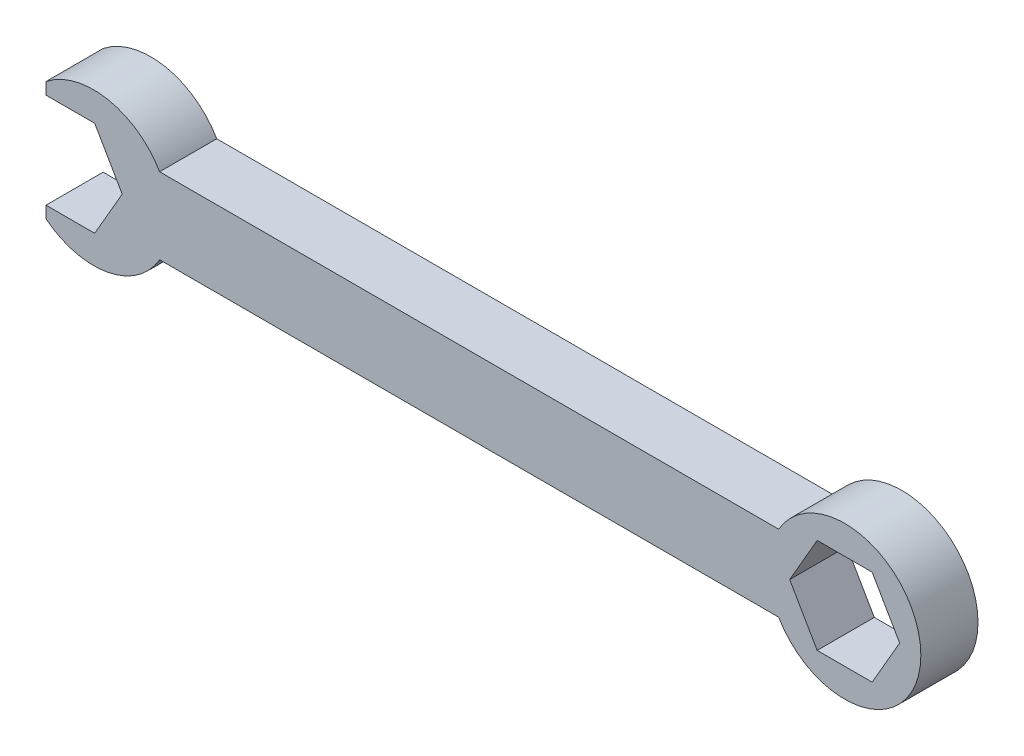
ISO-10303-21;
HEADER;
FILE_DESCRIPTION(('STEP AP214'),'2;1');
FILE_NAME('part.step','',(''),(''),'','','');
FILE_SCHEMA(('AUTOMOTIVE_DESIGN { 1 0 10303 214 1 1 1 1 }'));
ENDSEC;
DATA;
#1=APPLICATION_CONTEXT('core data for automotive mechanical design processes');
#2=APPLICATION_PROTOCOL_DEFINITION('international standard','automotive_design',2000,#1);
#3=PRODUCT_CONTEXT('',#1,'mechanical');
#4=PRODUCT('Part','Part','',(#3));
#5=PRODUCT_RELATED_PRODUCT_CATEGORY('part','',(#4));
#6=PRODUCT_DEFINITION_FORMATION('','',#4);
#7=PRODUCT_DEFINITION_CONTEXT('part definition',#1,'design');
#8=PRODUCT_DEFINITION('design','',#6,#7);
#9=PRODUCT_DEFINITION_SHAPE('','',#8);
#10=(LENGTH_UNIT() NAMED_UNIT(*) SI_UNIT(.MILLI.,.METRE.));
#11=(NAMED_UNIT(*) PLANE_ANGLE_UNIT() SI_UNIT($,.RADIAN.));
#12=(NAMED_UNIT(*) SI_UNIT($,.STERADIAN.) SOLID_ANGLE_UNIT());
#13=UNCERTAINTY_MEASURE_WITH_UNIT(LENGTH_MEASURE(1.E-05),#10,'distance_accuracy_value','');
#14=(GEOMETRIC_REPRESENTATION_CONTEXT(3) GLOBAL_UNCERTAINTY_ASSIGNED_CONTEXT((#13)) GLOBAL_UNIT_ASSIGNED_CONTEXT((#10,
#11,#12)) REPRESENTATION_CONTEXT('',''));
#15=CARTESIAN_POINT('',(0.,0.,0.));
#16=DIRECTION('',(0.,0.,1.));
#17=DIRECTION('',(1.,0.,0.));
#18=AXIS2_PLACEMENT_3D('',#15,#16,#17);
#19=CARTESIAN_POINT('',(0.,5.08000000000001,7.62));
#20=DIRECTION('',(0.,-1.,0.));
#21=DIRECTION('',(1.,0.,0.));
#22=AXIS2_PLACEMENT_3D('',#19,#20,#21);
#23=PLANE('',#22);
#24=DIRECTION('',(-1.,0.,0.));
#25=VECTOR('',#24,1.);
#26=CARTESIAN_POINT('',(0.,5.08000000000001,0.));
#27=LINE('',#26,#25);
#28=CARTESIAN_POINT('',(-8.79881810244989,5.08000000000001,0.));
#29=VERTEX_POINT('',#28);
#30=CARTESIAN_POINT('',(-91.3488181024499,5.08,0.));
#31=VERTEX_POINT('',#30);
#32=EDGE_CURVE('E214',#29,#31,#27,.T.);
#33=ORIENTED_EDGE('',*,*,#32,.T.);
#34=DIRECTION('',(0.,0.,-1.));
#35=VECTOR('',#34,1.);
#36=CARTESIAN_POINT('',(-91.3488181024499,5.08,7.62));
#37=LINE('',#36,#35);
#38=CARTESIAN_POINT('',(-91.3488181024499,5.08,7.62));
#39=VERTEX_POINT('',#38);
#40=EDGE_CURVE('E11',#39,#31,#37,.T.);
#41=ORIENTED_EDGE('',*,*,#40,.F.);
#42=DIRECTION('',(-1.,0.,0.));
#43=VECTOR('',#42,1.);
#44=CARTESIAN_POINT('',(0.,5.08000000000001,7.62));
#45=LINE('',#44,#43);
#46=CARTESIAN_POINT('',(-8.79881810244989,5.08000000000001,7.62));
#47=VERTEX_POINT('',#46);
#48=EDGE_CURVE('E295',#47,#39,#45,.T.);
#49=ORIENTED_EDGE('',*,*,#48,.F.);
#50=DIRECTION('',(0.,0.,-1.));
#51=VECTOR('',#50,1.);
#52=CARTESIAN_POINT('',(-8.79881810244989,5.08000000000001,7.62));
#53=LINE('',#52,#51);
#54=EDGE_CURVE('E238',#47,#29,#53,.T.);
#55=ORIENTED_EDGE('',*,*,#54,.T.);
#56=EDGE_LOOP('',(#33,#41,#49,#55));
#57=FACE_BOUND('',#56,.T.);
#58=ADVANCED_FACE('F38',(#57),#23,.F.);
#59=CARTESIAN_POINT('',(-100.1476362049,0.,7.62));
#60=DIRECTION('',(0.,0.,-1.));
#61=DIRECTION('',(-1.,0.,0.));
#62=AXIS2_PLACEMENT_3D('',#59,#60,#61);
#63=CYLINDRICAL_SURFACE('',#62,10.16);
#64=CARTESIAN_POINT('',(-100.1476362049,0.,0.));
#65=DIRECTION('',(0.,0.,1.));
#66=DIRECTION('',(1.,0.,0.));
#67=AXIS2_PLACEMENT_3D('',#64,#65,#66);
#68=CIRCLE('',#67,10.16);
#69=CARTESIAN_POINT('',(-106.4976362049,7.93114745796597,0.));
#70=VERTEX_POINT('',#69);
#71=EDGE_CURVE('E217',#31,#70,#68,.T.);
#72=ORIENTED_EDGE('',*,*,#71,.T.);
#73=DIRECTION('',(0.,0.,-1.));
#74=VECTOR('',#73,1.);
#75=CARTESIAN_POINT('',(-106.4976362049,7.93114745796597,7.62));
#76=LINE('',#75,#74);
#77=CARTESIAN_POINT('',(-106.4976362049,7.93114745796597,7.62));
#78=VERTEX_POINT('',#77);
#79=EDGE_CURVE('E48',#78,#70,#76,.T.);
#80=ORIENTED_EDGE('',*,*,#79,.F.);
#81=CARTESIAN_POINT('',(-100.1476362049,0.,7.62));
#82=DIRECTION('',(0.,0.,1.));
#83=DIRECTION('',(1.,0.,0.));
#84=AXIS2_PLACEMENT_3D('',#81,#82,#83);
#85=CIRCLE('',#84,10.16);
#86=EDGE_CURVE('E180',#39,#78,#85,.T.);
#87=ORIENTED_EDGE('',*,*,#86,.F.);
#88=ORIENTED_EDGE('',*,*,#40,.T.);
#89=EDGE_LOOP('',(#72,#80,#87,#88));
#90=FACE_BOUND('',#89,.T.);
#91=ADVANCED_FACE('F332',(#90),#63,.T.);
#92=CARTESIAN_POINT('',(-106.4976362049,0.,7.62));
#93=DIRECTION('',(1.,0.,0.));
#94=DIRECTION('',(0.,0.,-1.));
#95=AXIS2_PLACEMENT_3D('',#92,#93,#94);
#96=PLANE('',#95);
#97=DIRECTION('',(0.,-1.,0.));
#98=VECTOR('',#97,1.);
#99=CARTESIAN_POINT('',(-106.4976362049,0.,0.));
#100=LINE('',#99,#98);
#101=CARTESIAN_POINT('',(-106.4976362049,6.35,0.));
#102=VERTEX_POINT('',#101);
#103=EDGE_CURVE('E219',#70,#102,#100,.T.);
#104=ORIENTED_EDGE('',*,*,#103,.T.);
#105=DIRECTION('',(0.,0.,-1.));
#106=VECTOR('',#105,1.);
#107=CARTESIAN_POINT('',(-106.4976362049,6.35,7.62));
#108=LINE('',#107,#106);
#109=CARTESIAN_POINT('',(-106.4976362049,6.35,7.62));
#110=VERTEX_POINT('',#109);
#111=EDGE_CURVE('E250',#110,#102,#108,.T.);
#112=ORIENTED_EDGE('',*,*,#111,.F.);
#113=DIRECTION('',(0.,-1.,0.));
#114=VECTOR('',#113,1.);
#115=CARTESIAN_POINT('',(-106.4976362049,0.,7.62));
#116=LINE('',#115,#114);
#117=EDGE_CURVE('E297',#78,#110,#116,.T.);
#118=ORIENTED_EDGE('',*,*,#117,.F.);
#119=ORIENTED_EDGE('',*,*,#79,.T.);
#120=EDGE_LOOP('',(#104,#112,#118,#119));
#121=FACE_BOUND('',#120,.T.);
#122=ADVANCED_FACE('F326',(#121),#96,.F.);
#123=CARTESIAN_POINT('',(0.,6.35000000000005,7.62));
#124=DIRECTION('',(0.,-1.,0.));
#125=DIRECTION('',(1.,0.,0.));
#126=AXIS2_PLACEMENT_3D('',#123,#124,#125);
#127=PLANE('',#126);
#128=DIRECTION('',(-1.,0.,0.));
#129=VECTOR('',#128,1.);
#130=CARTESIAN_POINT('',(0.,6.35000000000005,0.));
#131=LINE('',#130,#129);
#132=CARTESIAN_POINT('',(-100.003810414254,6.34999999999999,0.));
#133=VERTEX_POINT('',#132);
#134=EDGE_CURVE('E222',#133,#102,#131,.T.);
#135=ORIENTED_EDGE('',*,*,#134,.F.);
#136=DIRECTION('',(0.,0.,-1.));
#137=VECTOR('',#136,1.);
#138=CARTESIAN_POINT('',(-100.003810414254,6.34999999999999,7.62));
#139=LINE('',#138,#137);
#140=CARTESIAN_POINT('',(-100.003810414254,6.34999999999999,7.62));
#141=VERTEX_POINT('',#140);
#142=EDGE_CURVE('E248',#141,#133,#139,.T.);
#143=ORIENTED_EDGE('',*,*,#142,.F.);
#144=DIRECTION('',(-1.,0.,0.));
#145=VECTOR('',#144,1.);
#146=CARTESIAN_POINT('',(0.,6.35000000000005,7.62));
#147=LINE('',#146,#145);
#148=EDGE_CURVE('E299',#141,#110,#147,.T.);
#149=ORIENTED_EDGE('',*,*,#148,.T.);
#150=ORIENTED_EDGE('',*,*,#111,.T.);
#151=EDGE_LOOP('',(#135,#143,#149,#150));
#152=FACE_BOUND('',#151,.T.);
#153=ADVANCED_FACE('F335',(#152),#127,.T.);
#154=CARTESIAN_POINT('',(-72.2532271536748,-41.7154201469933,7.62));
#155=DIRECTION('',(-0.866025403784439,-0.5,0.));
#156=DIRECTION('',(0.5,-0.866025403784439,0.));
#157=AXIS2_PLACEMENT_3D('',#154,#155,#156);
#158=PLANE('',#157);
#159=DIRECTION('',(-0.5,0.866025403784439,0.));
#160=VECTOR('',#159,1.);
#161=CARTESIAN_POINT('',(-72.2532271536748,-41.7154201469933,0.));
#162=LINE('',#161,#160);
#163=CARTESIAN_POINT('',(-96.3376362048998,0.,0.));
#164=VERTEX_POINT('',#163);
#165=EDGE_CURVE('E226',#164,#133,#162,.T.);
#166=ORIENTED_EDGE('',*,*,#165,.F.);
#167=DIRECTION('',(0.,0.,-1.));
#168=VECTOR('',#167,1.);
#169=CARTESIAN_POINT('',(-96.3376362048998,0.,7.62));
#170=LINE('',#169,#168);
#171=CARTESIAN_POINT('',(-96.3376362048998,0.,7.62));
#172=VERTEX_POINT('',#171);
#173=EDGE_CURVE('E246',#172,#164,#170,.T.);
#174=ORIENTED_EDGE('',*,*,#173,.F.);
#175=DIRECTION('',(-0.5,0.866025403784439,0.));
#176=VECTOR('',#175,1.);
#177=CARTESIAN_POINT('',(-72.2532271536748,-41.7154201469933,7.62));
#178=LINE('',#177,#176);
#179=EDGE_CURVE('E302',#172,#141,#178,.T.);
#180=ORIENTED_EDGE('',*,*,#179,.T.);
#181=ORIENTED_EDGE('',*,*,#142,.T.);
#182=EDGE_LOOP('',(#166,#174,#180,#181));
#183=FACE_BOUND('',#182,.T.);
#184=ADVANCED_FACE('F317',(#183),#158,.T.);
#185=CARTESIAN_POINT('',(-72.253227153675,41.7154201469932,7.62));
#186=DIRECTION('',(-0.86602540378444,0.499999999999998,0.));
#187=DIRECTION('',(-0.499999999999998,-0.86602540378444,0.));
#188=AXIS2_PLACEMENT_3D('',#185,#186,#187);
#189=PLANE('',#188);
#190=DIRECTION('',(0.499999999999998,0.86602540378444,0.));
#191=VECTOR('',#190,1.);
#192=CARTESIAN_POINT('',(-72.253227153675,41.7154201469932,0.));
#193=LINE('',#192,#191);
#194=CARTESIAN_POINT('',(-100.003810414254,-6.35,0.));
#195=VERTEX_POINT('',#194);
#196=EDGE_CURVE('E229',#195,#164,#193,.T.);
#197=ORIENTED_EDGE('',*,*,#196,.F.);
#198=DIRECTION('',(0.,0.,-1.));
#199=VECTOR('',#198,1.);
#200=CARTESIAN_POINT('',(-100.003810414254,-6.35,7.62));
#201=LINE('',#200,#199);
#202=CARTESIAN_POINT('',(-100.003810414254,-6.35,7.62));
#203=VERTEX_POINT('',#202);
#204=EDGE_CURVE('E244',#203,#195,#201,.T.);
#205=ORIENTED_EDGE('',*,*,#204,.F.);
#206=DIRECTION('',(0.499999999999998,0.86602540378444,0.));
#207=VECTOR('',#206,1.);
#208=CARTESIAN_POINT('',(-72.253227153675,41.7154201469932,7.62));
#209=LINE('',#208,#207);
#210=EDGE_CURVE('E304',#203,#172,#209,.T.);
#211=ORIENTED_EDGE('',*,*,#210,.T.);
#212=ORIENTED_EDGE('',*,*,#173,.T.);
#213=EDGE_LOOP('',(#197,#205,#211,#212));
#214=FACE_BOUND('',#213,.T.);
#215=ADVANCED_FACE('F319',(#214),#189,.T.);
#216=CARTESIAN_POINT('',(0.,-6.34999999999994,7.62));
#217=DIRECTION('',(0.,1.,0.));
#218=DIRECTION('',(-1.,0.,0.));
#219=AXIS2_PLACEMENT_3D('',#216,#217,#218);
#220=PLANE('',#219);
#221=DIRECTION('',(1.,0.,0.));
#222=VECTOR('',#221,1.);
#223=CARTESIAN_POINT('',(0.,-6.34999999999994,0.));
#224=LINE('',#223,#222);
#225=CARTESIAN_POINT('',(-106.4976362049,-6.35,0.));
#226=VERTEX_POINT('',#225);
#227=EDGE_CURVE('E232',#226,#195,#224,.T.);
#228=ORIENTED_EDGE('',*,*,#227,.F.);
#229=DIRECTION('',(0.,0.,-1.));
#230=VECTOR('',#229,1.);
#231=CARTESIAN_POINT('',(-106.4976362049,-6.35,7.62));
#232=LINE('',#231,#230);
#233=CARTESIAN_POINT('',(-106.4976362049,-6.35,7.62));
#234=VERTEX_POINT('',#233);
#235=EDGE_CURVE('E242',#234,#226,#232,.T.);
#236=ORIENTED_EDGE('',*,*,#235,.F.);
#237=DIRECTION('',(1.,0.,0.));
#238=VECTOR('',#237,1.);
#239=CARTESIAN_POINT('',(0.,-6.34999999999994,7.62));
#240=LINE('',#239,#238);
#241=EDGE_CURVE('E193',#234,#203,#240,.T.);
#242=ORIENTED_EDGE('',*,*,#241,.T.);
#243=ORIENTED_EDGE('',*,*,#204,.T.);
#244=EDGE_LOOP('',(#228,#236,#242,#243));
#245=FACE_BOUND('',#244,.T.);
#246=ADVANCED_FACE('F311',(#245),#220,.T.);
#247=CARTESIAN_POINT('',(-106.4976362049,-7.93114745796597,0.));
#248=VERTEX_POINT('',#247);
#249=EDGE_CURVE('E223',#226,#248,#100,.T.);
#250=ORIENTED_EDGE('',*,*,#249,.T.);
#251=DIRECTION('',(0.,0.,-1.));
#252=VECTOR('',#251,1.);
#253=CARTESIAN_POINT('',(-106.4976362049,-7.93114745796597,7.62));
#254=LINE('',#253,#252);
#255=CARTESIAN_POINT('',(-106.4976362049,-7.93114745796597,7.62));
#256=VERTEX_POINT('',#255);
#257=EDGE_CURVE('E185',#256,#248,#254,.T.);
#258=ORIENTED_EDGE('',*,*,#257,.F.);
#259=EDGE_CURVE('E175',#234,#256,#116,.T.);
#260=ORIENTED_EDGE('',*,*,#259,.F.);
#261=ORIENTED_EDGE('',*,*,#235,.T.);
#262=EDGE_LOOP('',(#250,#258,#260,#261));
#263=FACE_BOUND('',#262,.T.);
#264=ADVANCED_FACE('F323',(#263),#96,.F.);
#265=CARTESIAN_POINT('',(-91.3488181024499,-5.08,0.));
#266=VERTEX_POINT('',#265);
#267=EDGE_CURVE('E184',#248,#266,#68,.T.);
#268=ORIENTED_EDGE('',*,*,#267,.T.);
#269=DIRECTION('',(0.,0.,-1.));
#270=VECTOR('',#269,1.);
#271=CARTESIAN_POINT('',(-91.3488181024499,-5.08,7.62));
#272=LINE('',#271,#270);
#273=CARTESIAN_POINT('',(-91.3488181024499,-5.08,7.62));
#274=VERTEX_POINT('',#273);
#275=EDGE_CURVE('E181',#274,#266,#272,.T.);
#276=ORIENTED_EDGE('',*,*,#275,.F.);
#277=EDGE_CURVE('E168',#256,#274,#85,.T.);
#278=ORIENTED_EDGE('',*,*,#277,.F.);
#279=ORIENTED_EDGE('',*,*,#257,.T.);
#280=EDGE_LOOP('',(#268,#276,#278,#279));
#281=FACE_BOUND('',#280,.T.);
#282=ADVANCED_FACE('F182',(#281),#63,.T.);
#283=CARTESIAN_POINT('',(0.,-5.08,7.62));
#284=DIRECTION('',(0.,1.,0.));
#285=DIRECTION('',(-1.,0.,0.));
#286=AXIS2_PLACEMENT_3D('',#283,#284,#285);
#287=PLANE('',#286);
#288=DIRECTION('',(1.,0.,0.));
#289=VECTOR('',#288,1.);
#290=CARTESIAN_POINT('',(0.,-5.08,0.));
#291=LINE('',#290,#289);
#292=CARTESIAN_POINT('',(-8.7988181024499,-5.08,0.));
#293=VERTEX_POINT('',#292);
#294=EDGE_CURVE('E113',#266,#293,#291,.T.);
#295=ORIENTED_EDGE('',*,*,#294,.T.);
#296=DIRECTION('',(0.,0.,-1.));
#297=VECTOR('',#296,1.);
#298=CARTESIAN_POINT('',(-8.7988181024499,-5.08,7.62));
#299=LINE('',#298,#297);
#300=CARTESIAN_POINT('',(-8.7988181024499,-5.08,7.62));
#301=VERTEX_POINT('',#300);
#302=EDGE_CURVE('E186',#301,#293,#299,.T.);
#303=ORIENTED_EDGE('',*,*,#302,.F.);
#304=DIRECTION('',(1.,0.,0.));
#305=VECTOR('',#304,1.);
#306=CARTESIAN_POINT('',(0.,-5.08,7.62));
#307=LINE('',#306,#305);
#308=EDGE_CURVE('E172',#274,#301,#307,.T.);
#309=ORIENTED_EDGE('',*,*,#308,.F.);
#310=ORIENTED_EDGE('',*,*,#275,.T.);
#311=EDGE_LOOP('',(#295,#303,#309,#310));
#312=FACE_BOUND('',#311,.T.);
#313=ADVANCED_FACE('F188',(#312),#287,.F.);
#314=CARTESIAN_POINT('',(5.49926131403119,-3.175,7.62));
#315=DIRECTION('',(-0.866025403784439,0.5,0.));
#316=DIRECTION('',(-0.5,-0.866025403784439,0.));
#317=AXIS2_PLACEMENT_3D('',#314,#315,#316);
#318=PLANE('',#317);
#319=DIRECTION('',(0.5,0.866025403784439,0.));
#320=VECTOR('',#319,1.);
#321=CARTESIAN_POINT('',(5.49926131403119,-3.175,0.));
#322=LINE('',#321,#320);
#323=CARTESIAN_POINT('',(3.66617420935413,-6.35,0.));
#324=VERTEX_POINT('',#323);
#325=CARTESIAN_POINT('',(7.33234841870825,0.,0.));
#326=VERTEX_POINT('',#325);
#327=EDGE_CURVE('E196',#324,#326,#322,.T.);
#328=ORIENTED_EDGE('',*,*,#327,.F.);
#329=DIRECTION('',(0.,0.,-1.));
#330=VECTOR('',#329,1.);
#331=CARTESIAN_POINT('',(3.66617420935413,-6.35,7.62));
#332=LINE('',#331,#330);
#333=CARTESIAN_POINT('',(3.66617420935413,-6.35,7.62));
#334=VERTEX_POINT('',#333);
#335=EDGE_CURVE('E42',#334,#324,#332,.T.);
#336=ORIENTED_EDGE('',*,*,#335,.F.);
#337=DIRECTION('',(0.5,0.866025403784439,0.));
#338=VECTOR('',#337,1.);
#339=CARTESIAN_POINT('',(5.49926131403119,-3.175,7.62));
#340=LINE('',#339,#338);
#341=CARTESIAN_POINT('',(7.33234841870825,0.,7.62));
#342=VERTEX_POINT('',#341);
#343=EDGE_CURVE('E237',#334,#342,#340,.T.);
#344=ORIENTED_EDGE('',*,*,#343,.T.);
#345=DIRECTION('',(0.,0.,-1.));
#346=VECTOR('',#345,1.);
#347=CARTESIAN_POINT('',(7.33234841870825,0.,7.62));
#348=LINE('',#347,#346);
#349=EDGE_CURVE('E190',#342,#326,#348,.T.);
#350=ORIENTED_EDGE('',*,*,#349,.T.);
#351=EDGE_LOOP('',(#328,#336,#344,#350));
#352=FACE_BOUND('',#351,.T.);
#353=ADVANCED_FACE('F40',(#352),#318,.T.);
#354=CARTESIAN_POINT('',(0.,-6.35,7.62));
#355=DIRECTION('',(0.,1.,0.));
#356=DIRECTION('',(-1.,0.,0.));
#357=AXIS2_PLACEMENT_3D('',#354,#355,#356);
#358=PLANE('',#357);
#359=DIRECTION('',(1.,0.,0.));
#360=VECTOR('',#359,1.);
#361=CARTESIAN_POINT('',(0.,-6.35,0.));
#362=LINE('',#361,#360);
#363=CARTESIAN_POINT('',(-3.66617420935412,-6.35,0.));
#364=VERTEX_POINT('',#363);
#365=EDGE_CURVE('E199',#364,#324,#362,.T.);
#366=ORIENTED_EDGE('',*,*,#365,.F.);
#367=DIRECTION('',(0.,0.,-1.));
#368=VECTOR('',#367,1.);
#369=CARTESIAN_POINT('',(-3.66617420935412,-6.35,7.62));
#370=LINE('',#369,#368);
#371=CARTESIAN_POINT('',(-3.66617420935412,-6.35,7.62));
#372=VERTEX_POINT('',#371);
#373=EDGE_CURVE('E260',#372,#364,#370,.T.);
#374=ORIENTED_EDGE('',*,*,#373,.F.);
#375=DIRECTION('',(1.,0.,0.));
#376=VECTOR('',#375,1.);
#377=CARTESIAN_POINT('',(0.,-6.35,7.62));
#378=LINE('',#377,#376);
#379=EDGE_CURVE('E269',#372,#334,#378,.T.);
#380=ORIENTED_EDGE('',*,*,#379,.T.);
#381=ORIENTED_EDGE('',*,*,#335,.T.);
#382=EDGE_LOOP('',(#366,#374,#380,#381));
#383=FACE_BOUND('',#382,.T.);
#384=ADVANCED_FACE('F267',(#383),#358,.T.);
#385=CARTESIAN_POINT('',(-5.49926131403118,-3.175,7.62));
#386=DIRECTION('',(0.866025403784439,0.5,0.));
#387=DIRECTION('',(-0.5,0.866025403784439,0.));
#388=AXIS2_PLACEMENT_3D('',#385,#386,#387);
#389=PLANE('',#388);
#390=DIRECTION('',(0.5,-0.866025403784439,0.));
#391=VECTOR('',#390,1.);
#392=CARTESIAN_POINT('',(-5.49926131403118,-3.175,0.));
#393=LINE('',#392,#391);
#394=CARTESIAN_POINT('',(-7.33234841870825,0.,0.));
#395=VERTEX_POINT('',#394);
#396=EDGE_CURVE('E202',#395,#364,#393,.T.);
#397=ORIENTED_EDGE('',*,*,#396,.F.);
#398=DIRECTION('',(0.,0.,-1.));
#399=VECTOR('',#398,1.);
#400=CARTESIAN_POINT('',(-7.33234841870825,0.,7.62));
#401=LINE('',#400,#399);
#402=CARTESIAN_POINT('',(-7.33234841870825,0.,7.62));
#403=VERTEX_POINT('',#402);
#404=EDGE_CURVE('E259',#403,#395,#401,.T.);
#405=ORIENTED_EDGE('',*,*,#404,.F.);
#406=DIRECTION('',(0.5,-0.866025403784439,0.));
#407=VECTOR('',#406,1.);
#408=CARTESIAN_POINT('',(-5.49926131403118,-3.175,7.62));
#409=LINE('',#408,#407);
#410=EDGE_CURVE('E277',#403,#372,#409,.T.);
#411=ORIENTED_EDGE('',*,*,#410,.T.);
#412=ORIENTED_EDGE('',*,*,#373,.T.);
#413=EDGE_LOOP('',(#397,#405,#411,#412));
#414=FACE_BOUND('',#413,.T.);
#415=ADVANCED_FACE('F275',(#414),#389,.T.);
#416=CARTESIAN_POINT('',(-5.49926131403119,3.175,7.62));
#417=DIRECTION('',(0.866025403784439,-0.5,0.));
#418=DIRECTION('',(0.5,0.866025403784439,0.));
#419=AXIS2_PLACEMENT_3D('',#416,#417,#418);
#420=PLANE('',#419);
#421=DIRECTION('',(-0.5,-0.866025403784439,0.));
#422=VECTOR('',#421,1.);
#423=CARTESIAN_POINT('',(-5.49926131403119,3.175,0.));
#424=LINE('',#423,#422);
#425=CARTESIAN_POINT('',(-3.66617420935412,6.35,0.));
#426=VERTEX_POINT('',#425);
#427=EDGE_CURVE('E205',#426,#395,#424,.T.);
#428=ORIENTED_EDGE('',*,*,#427,.F.);
#429=DIRECTION('',(0.,0.,-1.));
#430=VECTOR('',#429,1.);
#431=CARTESIAN_POINT('',(-3.66617420935412,6.35,7.62));
#432=LINE('',#431,#430);
#433=CARTESIAN_POINT('',(-3.66617420935412,6.35,7.62));
#434=VERTEX_POINT('',#433);
#435=EDGE_CURVE('E257',#434,#426,#432,.T.);
#436=ORIENTED_EDGE('',*,*,#435,.F.);
#437=DIRECTION('',(-0.5,-0.866025403784439,0.));
#438=VECTOR('',#437,1.);
#439=CARTESIAN_POINT('',(-5.49926131403119,3.175,7.62));
#440=LINE('',#439,#438);
#441=EDGE_CURVE('E283',#434,#403,#440,.T.);
#442=ORIENTED_EDGE('',*,*,#441,.T.);
#443=ORIENTED_EDGE('',*,*,#404,.T.);
#444=EDGE_LOOP('',(#428,#436,#442,#443));
#445=FACE_BOUND('',#444,.T.);
#446=ADVANCED_FACE('F286',(#445),#420,.T.);
#447=CARTESIAN_POINT('',(0.,6.35,7.62));
#448=DIRECTION('',(0.,-1.,0.));
#449=DIRECTION('',(0.,0.,-1.));
#450=AXIS2_PLACEMENT_3D('',#447,#448,#449);
#451=PLANE('',#450);
#452=DIRECTION('',(-1.,0.,0.));
#453=VECTOR('',#452,1.);
#454=CARTESIAN_POINT('',(0.,6.35,0.));
#455=LINE('',#454,#453);
#456=CARTESIAN_POINT('',(3.66617420935412,6.35,0.));
#457=VERTEX_POINT('',#456);
#458=EDGE_CURVE('E208',#457,#426,#455,.T.);
#459=ORIENTED_EDGE('',*,*,#458,.F.);
#460=DIRECTION('',(0.,0.,-1.));
#461=VECTOR('',#460,1.);
#462=CARTESIAN_POINT('',(3.66617420935412,6.35,7.62));
#463=LINE('',#462,#461);
#464=CARTESIAN_POINT('',(3.66617420935412,6.35,7.62));
#465=VERTEX_POINT('',#464);
#466=EDGE_CURVE('E255',#465,#457,#463,.T.);
#467=ORIENTED_EDGE('',*,*,#466,.F.);
#468=DIRECTION('',(-1.,0.,0.));
#469=VECTOR('',#468,1.);
#470=CARTESIAN_POINT('',(0.,6.35,7.62));
#471=LINE('',#470,#469);
#472=EDGE_CURVE('E287',#465,#434,#471,.T.);
#473=ORIENTED_EDGE('',*,*,#472,.T.);
#474=ORIENTED_EDGE('',*,*,#435,.T.);
#475=EDGE_LOOP('',(#459,#467,#473,#474));
#476=FACE_BOUND('',#475,.T.);
#477=ADVANCED_FACE('F351',(#476),#451,.T.);
#478=CARTESIAN_POINT('',(5.49926131403118,3.175,7.62));
#479=DIRECTION('',(-0.866025403784439,-0.5,0.));
#480=DIRECTION('',(0.5,-0.866025403784439,0.));
#481=AXIS2_PLACEMENT_3D('',#478,#479,#480);
#482=PLANE('',#481);
#483=DIRECTION('',(-0.5,0.866025403784439,0.));
#484=VECTOR('',#483,1.);
#485=CARTESIAN_POINT('',(5.49926131403118,3.175,0.));
#486=LINE('',#485,#484);
#487=EDGE_CURVE('E211',#326,#457,#486,.T.);
#488=ORIENTED_EDGE('',*,*,#487,.F.);
#489=ORIENTED_EDGE('',*,*,#349,.F.);
#490=DIRECTION('',(-0.5,0.866025403784439,0.));
#491=VECTOR('',#490,1.);
#492=CARTESIAN_POINT('',(5.49926131403118,3.175,7.62));
#493=LINE('',#492,#491);
#494=EDGE_CURVE('E289',#342,#465,#493,.T.);
#495=ORIENTED_EDGE('',*,*,#494,.T.);
#496=ORIENTED_EDGE('',*,*,#466,.T.);
#497=EDGE_LOOP('',(#488,#489,#495,#496));
#498=FACE_BOUND('',#497,.T.);
#499=ADVANCED_FACE('F347',(#498),#482,.T.);
#500=CARTESIAN_POINT('',(0.,0.,7.62));
#501=DIRECTION('',(0.,0.,-1.));
#502=DIRECTION('',(-1.,0.,0.));
#503=AXIS2_PLACEMENT_3D('',#500,#501,#502);
#504=CYLINDRICAL_SURFACE('',#503,10.16);
#505=CARTESIAN_POINT('',(0.,0.,0.));
#506=DIRECTION('',(0.,0.,1.));
#507=DIRECTION('',(1.,0.,0.));
#508=AXIS2_PLACEMENT_3D('',#505,#506,#507);
#509=CIRCLE('',#508,10.16);
#510=EDGE_CURVE('E119',#293,#29,#509,.T.);
#511=ORIENTED_EDGE('',*,*,#510,.T.);
#512=ORIENTED_EDGE('',*,*,#54,.F.);
#513=CARTESIAN_POINT('',(0.,0.,7.62));
#514=DIRECTION('',(0.,0.,1.));
#515=DIRECTION('',(1.,0.,0.));
#516=AXIS2_PLACEMENT_3D('',#513,#514,#515);
#517=CIRCLE('',#516,10.16);
#518=EDGE_CURVE('E57',#301,#47,#517,.T.);
#519=ORIENTED_EDGE('',*,*,#518,.F.);
#520=ORIENTED_EDGE('',*,*,#302,.T.);
#521=EDGE_LOOP('',(#511,#512,#519,#520));
#522=FACE_BOUND('',#521,.T.);
#523=ADVANCED_FACE('F350',(#522),#504,.T.);
#524=CARTESIAN_POINT('',(0.,0.,7.62));
#525=DIRECTION('',(0.,0.,1.));
#526=DIRECTION('',(1.,0.,0.));
#527=AXIS2_PLACEMENT_3D('',#524,#525,#526);
#528=PLANE('',#527);
#529=ORIENTED_EDGE('',*,*,#343,.F.);
#530=ORIENTED_EDGE('',*,*,#379,.F.);
#531=ORIENTED_EDGE('',*,*,#410,.F.);
#532=ORIENTED_EDGE('',*,*,#441,.F.);
#533=ORIENTED_EDGE('',*,*,#472,.F.);
#534=ORIENTED_EDGE('',*,*,#494,.F.);
#535=EDGE_LOOP('',(#529,#530,#531,#532,#533,#534));
#536=FACE_BOUND('',#535,.T.);
#537=ORIENTED_EDGE('',*,*,#48,.T.);
#538=ORIENTED_EDGE('',*,*,#86,.T.);
#539=ORIENTED_EDGE('',*,*,#117,.T.);
#540=ORIENTED_EDGE('',*,*,#148,.F.);
#541=ORIENTED_EDGE('',*,*,#179,.F.);
#542=ORIENTED_EDGE('',*,*,#210,.F.);
#543=ORIENTED_EDGE('',*,*,#241,.F.);
#544=ORIENTED_EDGE('',*,*,#259,.T.);
#545=ORIENTED_EDGE('',*,*,#277,.T.);
#546=ORIENTED_EDGE('',*,*,#308,.T.);
#547=ORIENTED_EDGE('',*,*,#518,.T.);
#548=EDGE_LOOP('',(#537,#538,#539,#540,#541,#542,#543,#544,#545,#546,#547));
#549=FACE_BOUND('',#548,.T.);
#550=ADVANCED_FACE('F170',(#536,#549),#528,.T.);
#551=CARTESIAN_POINT('',(0.,0.,0.));
#552=DIRECTION('',(0.,0.,1.));
#553=DIRECTION('',(1.,0.,0.));
#554=AXIS2_PLACEMENT_3D('',#551,#552,#553);
#555=PLANE('',#554);
#556=ORIENTED_EDGE('',*,*,#327,.T.);
#557=ORIENTED_EDGE('',*,*,#487,.T.);
#558=ORIENTED_EDGE('',*,*,#458,.T.);
#559=ORIENTED_EDGE('',*,*,#427,.T.);
#560=ORIENTED_EDGE('',*,*,#396,.T.);
#561=ORIENTED_EDGE('',*,*,#365,.T.);
#562=EDGE_LOOP('',(#556,#557,#558,#559,#560,#561));
#563=FACE_BOUND('',#562,.T.);
#564=ORIENTED_EDGE('',*,*,#32,.F.);
#565=ORIENTED_EDGE('',*,*,#510,.F.);
#566=ORIENTED_EDGE('',*,*,#294,.F.);
#567=ORIENTED_EDGE('',*,*,#267,.F.);
#568=ORIENTED_EDGE('',*,*,#249,.F.);
#569=ORIENTED_EDGE('',*,*,#227,.T.);
#570=ORIENTED_EDGE('',*,*,#196,.T.);
#571=ORIENTED_EDGE('',*,*,#165,.T.);
#572=ORIENTED_EDGE('',*,*,#134,.T.);
#573=ORIENTED_EDGE('',*,*,#103,.F.);
#574=ORIENTED_EDGE('',*,*,#71,.F.);
#575=EDGE_LOOP('',(#564,#565,#566,#567,#568,#569,#570,#571,#572,#573,#574));
#576=FACE_BOUND('',#575,.T.);
#577=ADVANCED_FACE('F272',(#563,#576),#555,.F.);
#578=CLOSED_SHELL('',(#58,#91,#122,#153,#184,#215,#246,#264,#282,#313,#353,#384,#415,#446,#477,
#499,#523,#550,#577));
#579=MANIFOLD_SOLID_BREP('B2',#578);
#580=ADVANCED_BREP_SHAPE_REPRESENTATION('',(#18,#579),#14);
#581=SHAPE_DEFINITION_REPRESENTATION(#9,#580);
ENDSEC;
END-ISO-10303-21;
